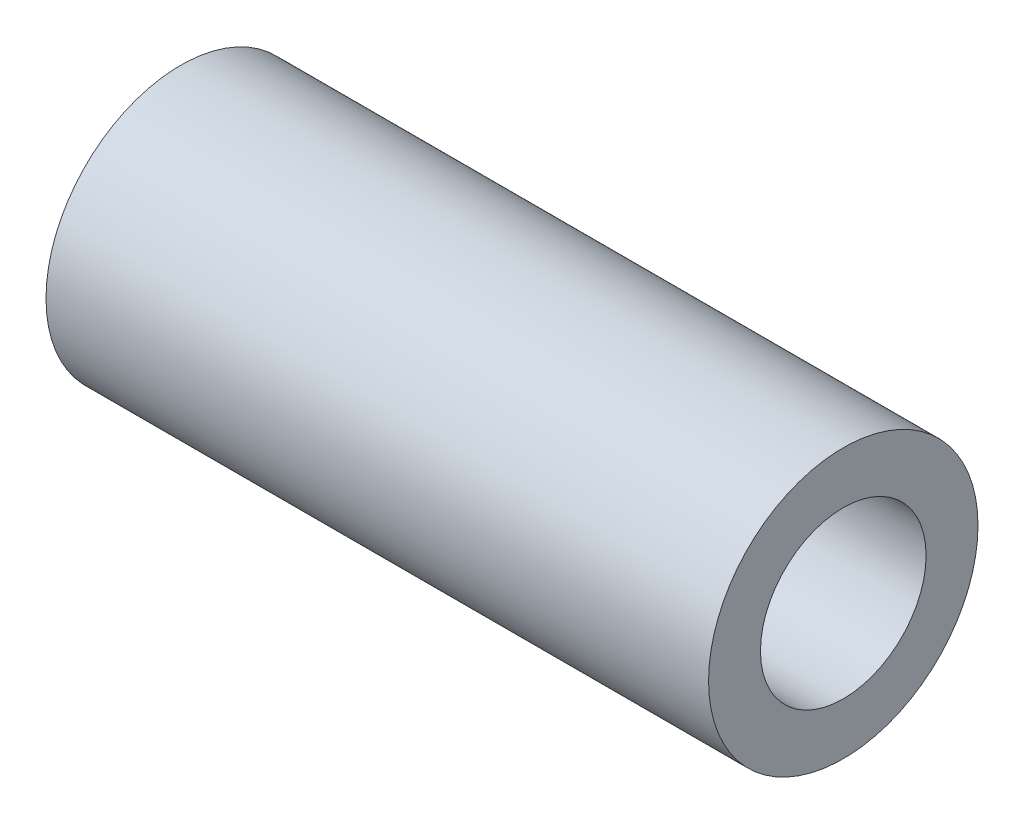
ISO-10303-21;
HEADER;
FILE_DESCRIPTION(('STEP AP214'),'2;1');
FILE_NAME('part.step','',(''),(''),'','','');
FILE_SCHEMA(('AUTOMOTIVE_DESIGN { 1 0 10303 214 1 1 1 1 }'));
ENDSEC;
DATA;
#1=APPLICATION_CONTEXT('core data for automotive mechanical design processes');
#2=APPLICATION_PROTOCOL_DEFINITION('international standard','automotive_design',2000,#1);
#3=PRODUCT_CONTEXT('',#1,'mechanical');
#4=PRODUCT('Part','Part','',(#3));
#5=PRODUCT_RELATED_PRODUCT_CATEGORY('part','',(#4));
#6=PRODUCT_DEFINITION_FORMATION('','',#4);
#7=PRODUCT_DEFINITION_CONTEXT('part definition',#1,'design');
#8=PRODUCT_DEFINITION('design','',#6,#7);
#9=PRODUCT_DEFINITION_SHAPE('','',#8);
#10=(LENGTH_UNIT() NAMED_UNIT(*) SI_UNIT(.MILLI.,.METRE.));
#11=(NAMED_UNIT(*) PLANE_ANGLE_UNIT() SI_UNIT($,.RADIAN.));
#12=(NAMED_UNIT(*) SI_UNIT($,.STERADIAN.) SOLID_ANGLE_UNIT());
#13=UNCERTAINTY_MEASURE_WITH_UNIT(LENGTH_MEASURE(1.E-05),#10,'distance_accuracy_value','');
#14=(GEOMETRIC_REPRESENTATION_CONTEXT(3) GLOBAL_UNCERTAINTY_ASSIGNED_CONTEXT((#13)) GLOBAL_UNIT_ASSIGNED_CONTEXT((#10,
#11,#12)) REPRESENTATION_CONTEXT('',''));
#15=CARTESIAN_POINT('',(0.,0.,0.));
#16=DIRECTION('',(0.,0.,1.));
#17=DIRECTION('',(1.,0.,0.));
#18=AXIS2_PLACEMENT_3D('',#15,#16,#17);
#19=CARTESIAN_POINT('',(0.,0.,0.));
#20=DIRECTION('',(-1.,0.,0.));
#21=DIRECTION('',(0.,0.,1.));
#22=AXIS2_PLACEMENT_3D('',#19,#20,#21);
#23=PLANE('',#22);
#24=CARTESIAN_POINT('',(0.,0.,0.));
#25=DIRECTION('',(1.,0.,0.));
#26=DIRECTION('',(0.,0.,-1.));
#27=AXIS2_PLACEMENT_3D('',#24,#25,#26);
#28=CIRCLE('',#27,3.8735);
#29=CARTESIAN_POINT('',(0.,0.,-3.8735));
#30=VERTEX_POINT('',#29);
#31=EDGE_CURVE('E10',#30,#30,#28,.T.);
#32=ORIENTED_EDGE('',*,*,#31,.F.);
#33=EDGE_LOOP('',(#32));
#34=FACE_BOUND('',#33,.T.);
#35=ADVANCED_FACE('F31',(#34),#23,.T.);
#36=CARTESIAN_POINT('',(12.7,0.,0.));
#37=DIRECTION('',(1.,0.,0.));
#38=DIRECTION('',(0.,0.,-1.));
#39=AXIS2_PLACEMENT_3D('',#36,#37,#38);
#40=CYLINDRICAL_SURFACE('',#39,3.8735);
#41=ORIENTED_EDGE('',*,*,#31,.T.);
#42=EDGE_LOOP('',(#41));
#43=FACE_BOUND('',#42,.T.);
#44=CARTESIAN_POINT('',(19.05,0.,0.));
#45=DIRECTION('',(1.,0.,0.));
#46=DIRECTION('',(0.,0.,-1.));
#47=AXIS2_PLACEMENT_3D('',#44,#45,#46);
#48=CIRCLE('',#47,3.8735);
#49=CARTESIAN_POINT('',(19.05,0.,-3.8735));
#50=VERTEX_POINT('',#49);
#51=EDGE_CURVE('E37',#50,#50,#48,.T.);
#52=ORIENTED_EDGE('',*,*,#51,.F.);
#53=EDGE_LOOP('',(#52));
#54=FACE_BOUND('',#53,.T.);
#55=ADVANCED_FACE('F63',(#43,#54),#40,.T.);
#56=CARTESIAN_POINT('',(19.05,0.,-3.8735));
#57=DIRECTION('',(1.,0.,0.));
#58=DIRECTION('',(0.,0.,-1.));
#59=AXIS2_PLACEMENT_3D('',#56,#57,#58);
#60=PLANE('',#59);
#61=ORIENTED_EDGE('',*,*,#51,.T.);
#62=EDGE_LOOP('',(#61));
#63=FACE_BOUND('',#62,.T.);
#64=CARTESIAN_POINT('',(19.05,0.,0.));
#65=DIRECTION('',(1.,0.,0.));
#66=DIRECTION('',(0.,0.,-1.));
#67=AXIS2_PLACEMENT_3D('',#64,#65,#66);
#68=CIRCLE('',#67,2.38125);
#69=CARTESIAN_POINT('',(19.05,0.,-2.38125));
#70=VERTEX_POINT('',#69);
#71=EDGE_CURVE('E41',#70,#70,#68,.T.);
#72=ORIENTED_EDGE('',*,*,#71,.F.);
#73=EDGE_LOOP('',(#72));
#74=FACE_BOUND('',#73,.T.);
#75=ADVANCED_FACE('F55',(#63,#74),#60,.T.);
#76=CARTESIAN_POINT('',(12.7,0.,0.));
#77=DIRECTION('',(1.,0.,0.));
#78=DIRECTION('',(0.,0.,-1.));
#79=AXIS2_PLACEMENT_3D('',#76,#77,#78);
#80=CYLINDRICAL_SURFACE('',#79,2.38125);
#81=ORIENTED_EDGE('',*,*,#71,.T.);
#82=EDGE_LOOP('',(#81));
#83=FACE_BOUND('',#82,.T.);
#84=CARTESIAN_POINT('',(12.7,0.,0.));
#85=DIRECTION('',(1.,0.,0.));
#86=DIRECTION('',(0.,0.,-1.));
#87=AXIS2_PLACEMENT_3D('',#84,#85,#86);
#88=CIRCLE('',#87,2.38125);
#89=CARTESIAN_POINT('',(12.7,0.,-2.38125));
#90=VERTEX_POINT('',#89);
#91=EDGE_CURVE('E45',#90,#90,#88,.T.);
#92=ORIENTED_EDGE('',*,*,#91,.F.);
#93=EDGE_LOOP('',(#92));
#94=FACE_BOUND('',#93,.T.);
#95=ADVANCED_FACE('F53',(#83,#94),#80,.F.);
#96=CARTESIAN_POINT('',(12.7,0.,-2.38125));
#97=DIRECTION('',(1.,0.,0.));
#98=DIRECTION('',(0.,0.,-1.));
#99=AXIS2_PLACEMENT_3D('',#96,#97,#98);
#100=PLANE('',#99);
#101=ORIENTED_EDGE('',*,*,#91,.T.);
#102=EDGE_LOOP('',(#101));
#103=FACE_BOUND('',#102,.T.);
#104=ADVANCED_FACE('F51',(#103),#100,.T.);
#105=CLOSED_SHELL('',(#35,#55,#75,#95,#104));
#106=MANIFOLD_SOLID_BREP('B2',#105);
#107=ADVANCED_BREP_SHAPE_REPRESENTATION('',(#18,#106),#14);
#108=SHAPE_DEFINITION_REPRESENTATION(#9,#107);
ENDSEC;
END-ISO-10303-21;
